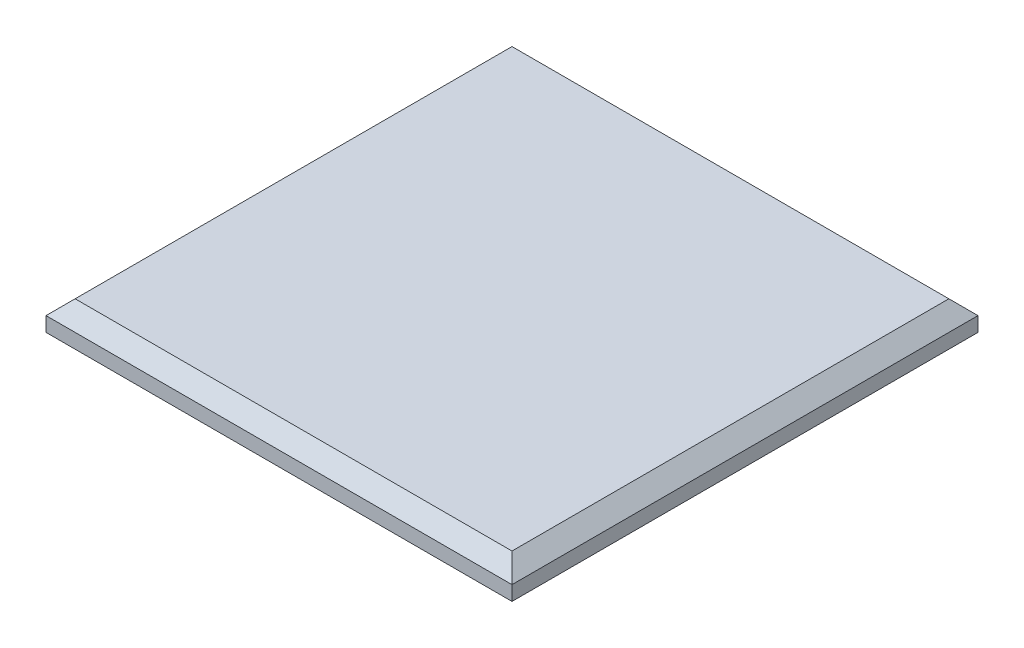
ISO-10303-21;
HEADER;
FILE_DESCRIPTION(('STEP AP214'),'2;1');
FILE_NAME('part.step','',(''),(''),'','','');
FILE_SCHEMA(('AUTOMOTIVE_DESIGN { 1 0 10303 214 1 1 1 1 }'));
ENDSEC;
DATA;
#1=APPLICATION_CONTEXT('core data for automotive mechanical design processes');
#2=APPLICATION_PROTOCOL_DEFINITION('international standard','automotive_design',2000,#1);
#3=PRODUCT_CONTEXT('',#1,'mechanical');
#4=PRODUCT('Part','Part','',(#3));
#5=PRODUCT_RELATED_PRODUCT_CATEGORY('part','',(#4));
#6=PRODUCT_DEFINITION_FORMATION('','',#4);
#7=PRODUCT_DEFINITION_CONTEXT('part definition',#1,'design');
#8=PRODUCT_DEFINITION('design','',#6,#7);
#9=PRODUCT_DEFINITION_SHAPE('','',#8);
#10=(LENGTH_UNIT() NAMED_UNIT(*) SI_UNIT(.MILLI.,.METRE.));
#11=(NAMED_UNIT(*) PLANE_ANGLE_UNIT() SI_UNIT($,.RADIAN.));
#12=(NAMED_UNIT(*) SI_UNIT($,.STERADIAN.) SOLID_ANGLE_UNIT());
#13=UNCERTAINTY_MEASURE_WITH_UNIT(LENGTH_MEASURE(1.E-05),#10,'distance_accuracy_value','');
#14=(GEOMETRIC_REPRESENTATION_CONTEXT(3) GLOBAL_UNCERTAINTY_ASSIGNED_CONTEXT((#13)) GLOBAL_UNIT_ASSIGNED_CONTEXT((#10,
#11,#12)) REPRESENTATION_CONTEXT('',''));
#15=CARTESIAN_POINT('',(0.,0.,0.));
#16=DIRECTION('',(0.,0.,1.));
#17=DIRECTION('',(1.,0.,0.));
#18=AXIS2_PLACEMENT_3D('',#15,#16,#17);
#19=CARTESIAN_POINT('',(50.8,9.525,50.8));
#20=DIRECTION('',(-1.,0.,0.));
#21=DIRECTION('',(0.,0.,1.));
#22=AXIS2_PLACEMENT_3D('',#19,#20,#21);
#23=PLANE('',#22);
#24=DIRECTION('',(0.,-1.,0.));
#25=VECTOR('',#24,1.);
#26=CARTESIAN_POINT('',(50.8,9.525,-50.8));
#27=LINE('',#26,#25);
#28=CARTESIAN_POINT('',(50.8,6.34999999999995,-50.8));
#29=VERTEX_POINT('',#28);
#30=CARTESIAN_POINT('',(50.8,3.175,-50.8));
#31=VERTEX_POINT('',#30);
#32=EDGE_CURVE('E172',#29,#31,#27,.T.);
#33=ORIENTED_EDGE('',*,*,#32,.F.);
#34=DIRECTION('',(0.,0.,1.));
#35=VECTOR('',#34,1.);
#36=CARTESIAN_POINT('',(50.8,6.34999999999995,50.8));
#37=LINE('',#36,#35);
#38=CARTESIAN_POINT('',(50.8,6.34999999999995,50.8));
#39=VERTEX_POINT('',#38);
#40=EDGE_CURVE('E11',#29,#39,#37,.T.);
#41=ORIENTED_EDGE('',*,*,#40,.T.);
#42=DIRECTION('',(0.,-1.,0.));
#43=VECTOR('',#42,1.);
#44=CARTESIAN_POINT('',(50.8,9.525,50.8));
#45=LINE('',#44,#43);
#46=CARTESIAN_POINT('',(50.8,3.175,50.8));
#47=VERTEX_POINT('',#46);
#48=EDGE_CURVE('E166',#39,#47,#45,.T.);
#49=ORIENTED_EDGE('',*,*,#48,.T.);
#50=DIRECTION('',(0.,0.,1.));
#51=VECTOR('',#50,1.);
#52=CARTESIAN_POINT('',(50.8,3.175,-50.8));
#53=LINE('',#52,#51);
#54=EDGE_CURVE('E157',#31,#47,#53,.T.);
#55=ORIENTED_EDGE('',*,*,#54,.F.);
#56=EDGE_LOOP('',(#33,#41,#49,#55));
#57=FACE_BOUND('',#56,.T.);
#58=ADVANCED_FACE('F32',(#57),#23,.F.);
#59=CARTESIAN_POINT('',(-50.8,9.525,-50.8));
#60=DIRECTION('',(0.,0.,1.));
#61=DIRECTION('',(1.,0.,0.));
#62=AXIS2_PLACEMENT_3D('',#59,#60,#61);
#63=PLANE('',#62);
#64=DIRECTION('',(0.,-1.,0.));
#65=VECTOR('',#64,1.);
#66=CARTESIAN_POINT('',(-50.8,9.525,-50.8));
#67=LINE('',#66,#65);
#68=CARTESIAN_POINT('',(-50.8,6.34999999999995,-50.8));
#69=VERTEX_POINT('',#68);
#70=CARTESIAN_POINT('',(-50.8,3.175,-50.8));
#71=VERTEX_POINT('',#70);
#72=EDGE_CURVE('E170',#69,#71,#67,.T.);
#73=ORIENTED_EDGE('',*,*,#72,.F.);
#74=DIRECTION('',(1.,0.,0.));
#75=VECTOR('',#74,1.);
#76=CARTESIAN_POINT('',(-50.8,6.34999999999995,-50.8));
#77=LINE('',#76,#75);
#78=EDGE_CURVE('E41',#69,#29,#77,.T.);
#79=ORIENTED_EDGE('',*,*,#78,.T.);
#80=ORIENTED_EDGE('',*,*,#32,.T.);
#81=DIRECTION('',(1.,0.,0.));
#82=VECTOR('',#81,1.);
#83=CARTESIAN_POINT('',(-50.8,3.175,-50.8));
#84=LINE('',#83,#82);
#85=EDGE_CURVE('E151',#71,#31,#84,.T.);
#86=ORIENTED_EDGE('',*,*,#85,.F.);
#87=EDGE_LOOP('',(#73,#79,#80,#86));
#88=FACE_BOUND('',#87,.T.);
#89=ADVANCED_FACE('F230',(#88),#63,.F.);
#90=CARTESIAN_POINT('',(-50.8,9.525,50.8));
#91=DIRECTION('',(1.,0.,0.));
#92=DIRECTION('',(0.,0.,-1.));
#93=AXIS2_PLACEMENT_3D('',#90,#91,#92);
#94=PLANE('',#93);
#95=DIRECTION('',(0.,-1.,0.));
#96=VECTOR('',#95,1.);
#97=CARTESIAN_POINT('',(-50.8,9.525,50.8));
#98=LINE('',#97,#96);
#99=CARTESIAN_POINT('',(-50.8,6.34999999999995,50.8));
#100=VERTEX_POINT('',#99);
#101=CARTESIAN_POINT('',(-50.8,3.175,50.8));
#102=VERTEX_POINT('',#101);
#103=EDGE_CURVE('E168',#100,#102,#98,.T.);
#104=ORIENTED_EDGE('',*,*,#103,.F.);
#105=DIRECTION('',(0.,0.,-1.));
#106=VECTOR('',#105,1.);
#107=CARTESIAN_POINT('',(-50.8,6.34999999999995,50.8));
#108=LINE('',#107,#106);
#109=EDGE_CURVE('E56',#100,#69,#108,.T.);
#110=ORIENTED_EDGE('',*,*,#109,.T.);
#111=ORIENTED_EDGE('',*,*,#72,.T.);
#112=DIRECTION('',(0.,0.,-1.));
#113=VECTOR('',#112,1.);
#114=CARTESIAN_POINT('',(-50.8,3.175,50.8));
#115=LINE('',#114,#113);
#116=EDGE_CURVE('E163',#102,#71,#115,.T.);
#117=ORIENTED_EDGE('',*,*,#116,.F.);
#118=EDGE_LOOP('',(#104,#110,#111,#117));
#119=FACE_BOUND('',#118,.T.);
#120=ADVANCED_FACE('F226',(#119),#94,.F.);
#121=CARTESIAN_POINT('',(-50.8,9.525,50.8));
#122=DIRECTION('',(0.,0.,-1.));
#123=DIRECTION('',(-1.,0.,0.));
#124=AXIS2_PLACEMENT_3D('',#121,#122,#123);
#125=PLANE('',#124);
#126=ORIENTED_EDGE('',*,*,#48,.F.);
#127=DIRECTION('',(-1.,0.,0.));
#128=VECTOR('',#127,1.);
#129=CARTESIAN_POINT('',(-50.8,6.34999999999995,50.8));
#130=LINE('',#129,#128);
#131=EDGE_CURVE('E183',#39,#100,#130,.T.);
#132=ORIENTED_EDGE('',*,*,#131,.T.);
#133=ORIENTED_EDGE('',*,*,#103,.T.);
#134=DIRECTION('',(-1.,0.,0.));
#135=VECTOR('',#134,1.);
#136=CARTESIAN_POINT('',(50.8,3.175,50.8));
#137=LINE('',#136,#135);
#138=EDGE_CURVE('E160',#47,#102,#137,.T.);
#139=ORIENTED_EDGE('',*,*,#138,.F.);
#140=EDGE_LOOP('',(#126,#132,#133,#139));
#141=FACE_BOUND('',#140,.T.);
#142=ADVANCED_FACE('F213',(#141),#125,.F.);
#143=CARTESIAN_POINT('',(0.,9.525,0.));
#144=DIRECTION('',(0.,-1.,0.));
#145=DIRECTION('',(0.,0.,-1.));
#146=AXIS2_PLACEMENT_3D('',#143,#144,#145);
#147=PLANE('',#146);
#148=DIRECTION('',(0.,0.,1.));
#149=VECTOR('',#148,1.);
#150=CARTESIAN_POINT('',(-47.625,9.525,0.));
#151=LINE('',#150,#149);
#152=CARTESIAN_POINT('',(-47.625,9.525,-47.625));
#153=VERTEX_POINT('',#152);
#154=CARTESIAN_POINT('',(-47.625,9.525,47.625));
#155=VERTEX_POINT('',#154);
#156=EDGE_CURVE('E178',#153,#155,#151,.T.);
#157=ORIENTED_EDGE('',*,*,#156,.T.);
#158=DIRECTION('',(1.,0.,0.));
#159=VECTOR('',#158,1.);
#160=CARTESIAN_POINT('',(0.,9.525,47.625));
#161=LINE('',#160,#159);
#162=CARTESIAN_POINT('',(47.625,9.525,47.625));
#163=VERTEX_POINT('',#162);
#164=EDGE_CURVE('E180',#155,#163,#161,.T.);
#165=ORIENTED_EDGE('',*,*,#164,.T.);
#166=DIRECTION('',(0.,0.,-1.));
#167=VECTOR('',#166,1.);
#168=CARTESIAN_POINT('',(47.625,9.525,0.));
#169=LINE('',#168,#167);
#170=CARTESIAN_POINT('',(47.625,9.525,-47.625));
#171=VERTEX_POINT('',#170);
#172=EDGE_CURVE('E174',#163,#171,#169,.T.);
#173=ORIENTED_EDGE('',*,*,#172,.T.);
#174=DIRECTION('',(-1.,0.,0.));
#175=VECTOR('',#174,1.);
#176=CARTESIAN_POINT('',(0.,9.525,-47.625));
#177=LINE('',#176,#175);
#178=EDGE_CURVE('E176',#171,#153,#177,.T.);
#179=ORIENTED_EDGE('',*,*,#178,.T.);
#180=EDGE_LOOP('',(#157,#165,#173,#179));
#181=FACE_BOUND('',#180,.T.);
#182=ADVANCED_FACE('F218',(#181),#147,.F.);
#183=CARTESIAN_POINT('',(0.,3.175,0.));
#184=DIRECTION('',(0.,-1.,0.));
#185=DIRECTION('',(0.,0.,-1.));
#186=AXIS2_PLACEMENT_3D('',#183,#184,#185);
#187=PLANE('',#186);
#188=DIRECTION('',(1.,0.,0.));
#189=VECTOR('',#188,1.);
#190=CARTESIAN_POINT('',(-47.498,3.175,-47.498));
#191=LINE('',#190,#189);
#192=CARTESIAN_POINT('',(-47.498,3.175,-47.498));
#193=VERTEX_POINT('',#192);
#194=CARTESIAN_POINT('',(47.498,3.175,-47.498));
#195=VERTEX_POINT('',#194);
#196=EDGE_CURVE('E122',#193,#195,#191,.T.);
#197=ORIENTED_EDGE('',*,*,#196,.F.);
#198=DIRECTION('',(0.,0.,-1.));
#199=VECTOR('',#198,1.);
#200=CARTESIAN_POINT('',(-47.498,3.175,47.498));
#201=LINE('',#200,#199);
#202=CARTESIAN_POINT('',(-47.498,3.175,47.498));
#203=VERTEX_POINT('',#202);
#204=EDGE_CURVE('E132',#203,#193,#201,.T.);
#205=ORIENTED_EDGE('',*,*,#204,.F.);
#206=DIRECTION('',(-1.,0.,0.));
#207=VECTOR('',#206,1.);
#208=CARTESIAN_POINT('',(47.498,3.175,47.498));
#209=LINE('',#208,#207);
#210=CARTESIAN_POINT('',(47.498,3.175,47.498));
#211=VERTEX_POINT('',#210);
#212=EDGE_CURVE('E114',#211,#203,#209,.T.);
#213=ORIENTED_EDGE('',*,*,#212,.F.);
#214=DIRECTION('',(0.,0.,1.));
#215=VECTOR('',#214,1.);
#216=CARTESIAN_POINT('',(47.498,3.175,-47.498));
#217=LINE('',#216,#215);
#218=EDGE_CURVE('E129',#195,#211,#217,.T.);
#219=ORIENTED_EDGE('',*,*,#218,.F.);
#220=EDGE_LOOP('',(#197,#205,#213,#219));
#221=FACE_BOUND('',#220,.T.);
#222=ORIENTED_EDGE('',*,*,#85,.T.);
#223=ORIENTED_EDGE('',*,*,#54,.T.);
#224=ORIENTED_EDGE('',*,*,#138,.T.);
#225=ORIENTED_EDGE('',*,*,#116,.T.);
#226=EDGE_LOOP('',(#222,#223,#224,#225));
#227=FACE_BOUND('',#226,.T.);
#228=ADVANCED_FACE('F127',(#221,#227),#187,.T.);
#229=CARTESIAN_POINT('',(47.498,3.175,-47.498));
#230=DIRECTION('',(1.,0.,0.));
#231=DIRECTION('',(0.,0.,-1.));
#232=AXIS2_PLACEMENT_3D('',#229,#230,#231);
#233=PLANE('',#232);
#234=DIRECTION('',(0.,0.,1.));
#235=VECTOR('',#234,1.);
#236=CARTESIAN_POINT('',(47.498,0.,-47.498));
#237=LINE('',#236,#235);
#238=CARTESIAN_POINT('',(47.498,0.,-47.498));
#239=VERTEX_POINT('',#238);
#240=CARTESIAN_POINT('',(47.498,0.,47.498));
#241=VERTEX_POINT('',#240);
#242=EDGE_CURVE('E145',#239,#241,#237,.T.);
#243=ORIENTED_EDGE('',*,*,#242,.F.);
#244=DIRECTION('',(0.,-1.,0.));
#245=VECTOR('',#244,1.);
#246=CARTESIAN_POINT('',(47.498,3.175,-47.498));
#247=LINE('',#246,#245);
#248=EDGE_CURVE('E136',#195,#239,#247,.T.);
#249=ORIENTED_EDGE('',*,*,#248,.F.);
#250=ORIENTED_EDGE('',*,*,#218,.T.);
#251=DIRECTION('',(0.,-1.,0.));
#252=VECTOR('',#251,1.);
#253=CARTESIAN_POINT('',(47.498,3.175,47.498));
#254=LINE('',#253,#252);
#255=EDGE_CURVE('E110',#211,#241,#254,.T.);
#256=ORIENTED_EDGE('',*,*,#255,.T.);
#257=EDGE_LOOP('',(#243,#249,#250,#256));
#258=FACE_BOUND('',#257,.T.);
#259=ADVANCED_FACE('F135',(#258),#233,.T.);
#260=CARTESIAN_POINT('',(-47.498,3.175,-47.498));
#261=DIRECTION('',(0.,0.,-1.));
#262=DIRECTION('',(-1.,0.,0.));
#263=AXIS2_PLACEMENT_3D('',#260,#261,#262);
#264=PLANE('',#263);
#265=DIRECTION('',(1.,0.,0.));
#266=VECTOR('',#265,1.);
#267=CARTESIAN_POINT('',(-47.498,0.,-47.498));
#268=LINE('',#267,#266);
#269=CARTESIAN_POINT('',(-47.498,0.,-47.498));
#270=VERTEX_POINT('',#269);
#271=EDGE_CURVE('E137',#270,#239,#268,.T.);
#272=ORIENTED_EDGE('',*,*,#271,.F.);
#273=DIRECTION('',(0.,-1.,0.));
#274=VECTOR('',#273,1.);
#275=CARTESIAN_POINT('',(-47.498,3.175,-47.498));
#276=LINE('',#275,#274);
#277=EDGE_CURVE('E152',#193,#270,#276,.T.);
#278=ORIENTED_EDGE('',*,*,#277,.F.);
#279=ORIENTED_EDGE('',*,*,#196,.T.);
#280=ORIENTED_EDGE('',*,*,#248,.T.);
#281=EDGE_LOOP('',(#272,#278,#279,#280));
#282=FACE_BOUND('',#281,.T.);
#283=ADVANCED_FACE('F306',(#282),#264,.T.);
#284=CARTESIAN_POINT('',(-47.498,3.175,47.498));
#285=DIRECTION('',(-1.,0.,0.));
#286=DIRECTION('',(0.,0.,1.));
#287=AXIS2_PLACEMENT_3D('',#284,#285,#286);
#288=PLANE('',#287);
#289=DIRECTION('',(0.,0.,-1.));
#290=VECTOR('',#289,1.);
#291=CARTESIAN_POINT('',(-47.498,0.,47.498));
#292=LINE('',#291,#290);
#293=CARTESIAN_POINT('',(-47.498,0.,47.498));
#294=VERTEX_POINT('',#293);
#295=EDGE_CURVE('E140',#294,#270,#292,.T.);
#296=ORIENTED_EDGE('',*,*,#295,.F.);
#297=DIRECTION('',(0.,-1.,0.));
#298=VECTOR('',#297,1.);
#299=CARTESIAN_POINT('',(-47.498,3.175,47.498));
#300=LINE('',#299,#298);
#301=EDGE_CURVE('E121',#203,#294,#300,.T.);
#302=ORIENTED_EDGE('',*,*,#301,.F.);
#303=ORIENTED_EDGE('',*,*,#204,.T.);
#304=ORIENTED_EDGE('',*,*,#277,.T.);
#305=EDGE_LOOP('',(#296,#302,#303,#304));
#306=FACE_BOUND('',#305,.T.);
#307=ADVANCED_FACE('F253',(#306),#288,.T.);
#308=CARTESIAN_POINT('',(47.498,3.175,47.498));
#309=DIRECTION('',(0.,0.,1.));
#310=DIRECTION('',(1.,0.,0.));
#311=AXIS2_PLACEMENT_3D('',#308,#309,#310);
#312=PLANE('',#311);
#313=DIRECTION('',(-1.,0.,0.));
#314=VECTOR('',#313,1.);
#315=CARTESIAN_POINT('',(47.498,0.,47.498));
#316=LINE('',#315,#314);
#317=EDGE_CURVE('E116',#241,#294,#316,.T.);
#318=ORIENTED_EDGE('',*,*,#317,.F.);
#319=ORIENTED_EDGE('',*,*,#255,.F.);
#320=ORIENTED_EDGE('',*,*,#212,.T.);
#321=ORIENTED_EDGE('',*,*,#301,.T.);
#322=EDGE_LOOP('',(#318,#319,#320,#321));
#323=FACE_BOUND('',#322,.T.);
#324=ADVANCED_FACE('F112',(#323),#312,.T.);
#325=CARTESIAN_POINT('',(0.,0.,0.));
#326=DIRECTION('',(0.,-1.,0.));
#327=DIRECTION('',(0.,0.,-1.));
#328=AXIS2_PLACEMENT_3D('',#325,#326,#327);
#329=PLANE('',#328);
#330=ORIENTED_EDGE('',*,*,#271,.T.);
#331=ORIENTED_EDGE('',*,*,#242,.T.);
#332=ORIENTED_EDGE('',*,*,#317,.T.);
#333=ORIENTED_EDGE('',*,*,#295,.T.);
#334=EDGE_LOOP('',(#330,#331,#332,#333));
#335=FACE_BOUND('',#334,.T.);
#336=ADVANCED_FACE('F245',(#335),#329,.T.);
#337=CARTESIAN_POINT('',(0.,9.525,-47.625));
#338=DIRECTION('',(0.,-0.707106781186546,0.707106781186549));
#339=DIRECTION('',(-1.,0.,0.));
#340=AXIS2_PLACEMENT_3D('',#337,#338,#339);
#341=PLANE('',#340);
#342=DIRECTION('',(-0.577350269189625,0.577350269189628,0.577350269189625));
#343=VECTOR('',#342,1.);
#344=CARTESIAN_POINT('',(31.75,25.4,-31.75));
#345=LINE('',#344,#343);
#346=EDGE_CURVE('E191',#29,#171,#345,.T.);
#347=ORIENTED_EDGE('',*,*,#346,.F.);
#348=ORIENTED_EDGE('',*,*,#78,.F.);
#349=DIRECTION('',(0.577350269189625,0.577350269189628,0.577350269189625));
#350=VECTOR('',#349,1.);
#351=CARTESIAN_POINT('',(-31.75,25.4,-31.75));
#352=LINE('',#351,#350);
#353=EDGE_CURVE('E36',#153,#69,#352,.F.);
#354=ORIENTED_EDGE('',*,*,#353,.F.);
#355=ORIENTED_EDGE('',*,*,#178,.F.);
#356=EDGE_LOOP('',(#347,#348,#354,#355));
#357=FACE_BOUND('',#356,.T.);
#358=ADVANCED_FACE('F34',(#357),#341,.F.);
#359=CARTESIAN_POINT('',(-47.625,9.525,0.));
#360=DIRECTION('',(0.707106781186549,-0.707106781186546,0.));
#361=DIRECTION('',(0.,0.,1.));
#362=AXIS2_PLACEMENT_3D('',#359,#360,#361);
#363=PLANE('',#362);
#364=ORIENTED_EDGE('',*,*,#353,.T.);
#365=ORIENTED_EDGE('',*,*,#109,.F.);
#366=DIRECTION('',(0.577350269189625,0.577350269189628,-0.577350269189625));
#367=VECTOR('',#366,1.);
#368=CARTESIAN_POINT('',(-31.75,25.4,31.75));
#369=LINE('',#368,#367);
#370=EDGE_CURVE('E190',#155,#100,#369,.F.);
#371=ORIENTED_EDGE('',*,*,#370,.F.);
#372=ORIENTED_EDGE('',*,*,#156,.F.);
#373=EDGE_LOOP('',(#364,#365,#371,#372));
#374=FACE_BOUND('',#373,.T.);
#375=ADVANCED_FACE('F201',(#374),#363,.F.);
#376=CARTESIAN_POINT('',(47.625,9.525,0.));
#377=DIRECTION('',(-0.707106781186549,-0.707106781186546,0.));
#378=DIRECTION('',(0.,0.,-1.));
#379=AXIS2_PLACEMENT_3D('',#376,#377,#378);
#380=PLANE('',#379);
#381=ORIENTED_EDGE('',*,*,#346,.T.);
#382=ORIENTED_EDGE('',*,*,#172,.F.);
#383=DIRECTION('',(0.577350269189625,-0.577350269189628,0.577350269189625));
#384=VECTOR('',#383,1.);
#385=CARTESIAN_POINT('',(31.75,25.4,31.75));
#386=LINE('',#385,#384);
#387=EDGE_CURVE('E188',#39,#163,#386,.F.);
#388=ORIENTED_EDGE('',*,*,#387,.F.);
#389=ORIENTED_EDGE('',*,*,#40,.F.);
#390=EDGE_LOOP('',(#381,#382,#388,#389));
#391=FACE_BOUND('',#390,.T.);
#392=ADVANCED_FACE('F206',(#391),#380,.F.);
#393=CARTESIAN_POINT('',(0.,9.525,47.625));
#394=DIRECTION('',(0.,-0.707106781186546,-0.707106781186549));
#395=DIRECTION('',(1.,0.,0.));
#396=AXIS2_PLACEMENT_3D('',#393,#394,#395);
#397=PLANE('',#396);
#398=ORIENTED_EDGE('',*,*,#370,.T.);
#399=ORIENTED_EDGE('',*,*,#131,.F.);
#400=ORIENTED_EDGE('',*,*,#387,.T.);
#401=ORIENTED_EDGE('',*,*,#164,.F.);
#402=EDGE_LOOP('',(#398,#399,#400,#401));
#403=FACE_BOUND('',#402,.T.);
#404=ADVANCED_FACE('F215',(#403),#397,.F.);
#405=CLOSED_SHELL('',(#58,#89,#120,#142,#182,#228,#259,#283,#307,#324,#336,#358,#375,#392,#404));
#406=MANIFOLD_SOLID_BREP('B2',#405);
#407=ADVANCED_BREP_SHAPE_REPRESENTATION('',(#18,#406),#14);
#408=SHAPE_DEFINITION_REPRESENTATION(#9,#407);
ENDSEC;
END-ISO-10303-21;
